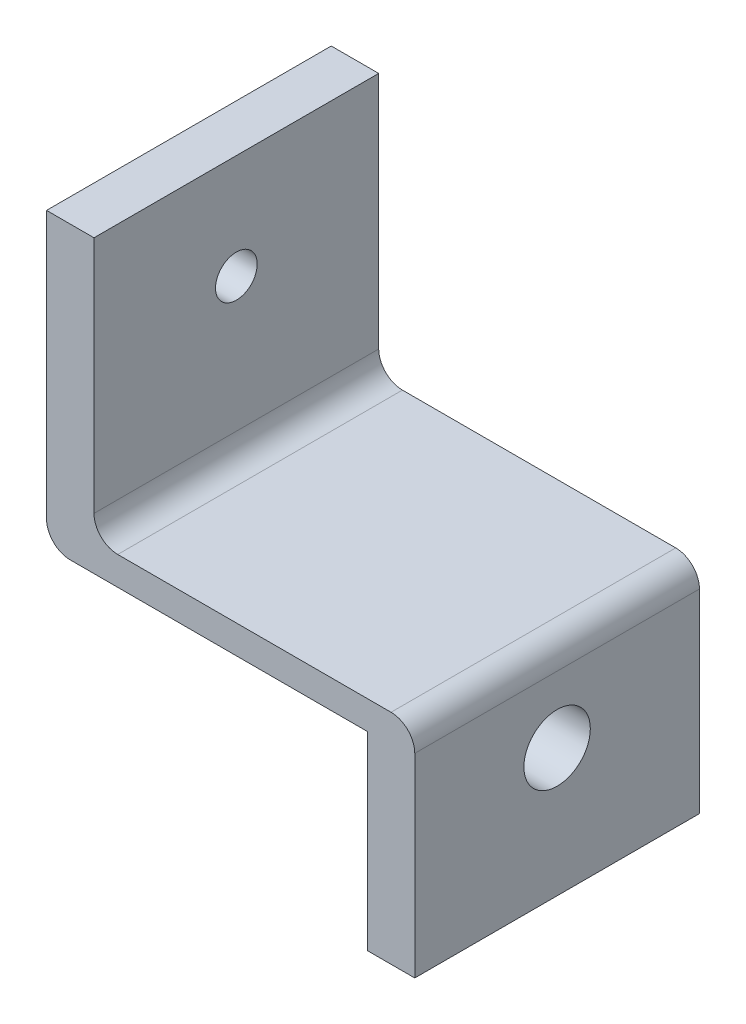
ISO-10303-21;
HEADER;
FILE_DESCRIPTION(('STEP AP214'),'2;1');
FILE_NAME('part.step','',(''),(''),'','','');
FILE_SCHEMA(('AUTOMOTIVE_DESIGN { 1 0 10303 214 1 1 1 1 }'));
ENDSEC;
DATA;
#1=APPLICATION_CONTEXT('core data for automotive mechanical design processes');
#2=APPLICATION_PROTOCOL_DEFINITION('international standard','automotive_design',2000,#1);
#3=PRODUCT_CONTEXT('',#1,'mechanical');
#4=PRODUCT('Part','Part','',(#3));
#5=PRODUCT_RELATED_PRODUCT_CATEGORY('part','',(#4));
#6=PRODUCT_DEFINITION_FORMATION('','',#4);
#7=PRODUCT_DEFINITION_CONTEXT('part definition',#1,'design');
#8=PRODUCT_DEFINITION('design','',#6,#7);
#9=PRODUCT_DEFINITION_SHAPE('','',#8);
#10=(LENGTH_UNIT() NAMED_UNIT(*) SI_UNIT(.MILLI.,.METRE.));
#11=(NAMED_UNIT(*) PLANE_ANGLE_UNIT() SI_UNIT($,.RADIAN.));
#12=(NAMED_UNIT(*) SI_UNIT($,.STERADIAN.) SOLID_ANGLE_UNIT());
#13=UNCERTAINTY_MEASURE_WITH_UNIT(LENGTH_MEASURE(1.E-05),#10,'distance_accuracy_value','');
#14=(GEOMETRIC_REPRESENTATION_CONTEXT(3) GLOBAL_UNCERTAINTY_ASSIGNED_CONTEXT((#13)) GLOBAL_UNIT_ASSIGNED_CONTEXT((#10,
#11,#12)) REPRESENTATION_CONTEXT('',''));
#15=CARTESIAN_POINT('',(0.,0.,0.));
#16=DIRECTION('',(0.,0.,1.));
#17=DIRECTION('',(1.,0.,0.));
#18=AXIS2_PLACEMENT_3D('',#15,#16,#17);
#19=CARTESIAN_POINT('',(5.00000000000023,2.4980018054066E-13,-30.));
#20=DIRECTION('',(1.,0.,0.));
#21=DIRECTION('',(0.,0.,-1.));
#22=AXIS2_PLACEMENT_3D('',#19,#20,#21);
#23=PLANE('',#22);
#24=CARTESIAN_POINT('',(5.00000000000023,19.6500000000003,-15.));
#25=DIRECTION('',(1.,0.,0.));
#26=DIRECTION('',(0.,0.,-1.));
#27=AXIS2_PLACEMENT_3D('',#24,#25,#26);
#28=CIRCLE('',#27,2.19709999999999);
#29=CARTESIAN_POINT('',(5.00000000000023,19.6500000000003,-17.1971));
#30=VERTEX_POINT('',#29);
#31=EDGE_CURVE('E195',#30,#30,#28,.T.);
#32=ORIENTED_EDGE('',*,*,#31,.F.);
#33=EDGE_LOOP('',(#32));
#34=FACE_BOUND('',#33,.T.);
#35=DIRECTION('',(0.,1.,0.));
#36=VECTOR('',#35,1.);
#37=CARTESIAN_POINT('',(5.,0.,0.));
#38=LINE('',#37,#36);
#39=CARTESIAN_POINT('',(5.,5.50000000000001,0.));
#40=VERTEX_POINT('',#39);
#41=CARTESIAN_POINT('',(5.,30.65,0.));
#42=VERTEX_POINT('',#41);
#43=EDGE_CURVE('E159',#40,#42,#38,.T.);
#44=ORIENTED_EDGE('',*,*,#43,.F.);
#45=DIRECTION('',(0.,0.,1.));
#46=VECTOR('',#45,1.);
#47=CARTESIAN_POINT('',(5.00000000000025,5.50000000000025,-30.));
#48=LINE('',#47,#46);
#49=CARTESIAN_POINT('',(5.00000000000025,5.50000000000025,-30.));
#50=VERTEX_POINT('',#49);
#51=EDGE_CURVE('E128',#40,#50,#48,.F.);
#52=ORIENTED_EDGE('',*,*,#51,.T.);
#53=DIRECTION('',(0.,1.,0.));
#54=VECTOR('',#53,1.);
#55=CARTESIAN_POINT('',(5.00000000000023,2.4980018054066E-13,-30.));
#56=LINE('',#55,#54);
#57=CARTESIAN_POINT('',(5.,30.6500000000002,-30.));
#58=VERTEX_POINT('',#57);
#59=EDGE_CURVE('E121',#50,#58,#56,.T.);
#60=ORIENTED_EDGE('',*,*,#59,.T.);
#61=DIRECTION('',(0.,0.,1.));
#62=VECTOR('',#61,1.);
#63=CARTESIAN_POINT('',(5.,30.6500000000002,-30.));
#64=LINE('',#63,#62);
#65=EDGE_CURVE('E125',#58,#42,#64,.T.);
#66=ORIENTED_EDGE('',*,*,#65,.T.);
#67=EDGE_LOOP('',(#44,#52,#60,#66));
#68=FACE_BOUND('',#67,.T.);
#69=ADVANCED_FACE('F38',(#34,#68),#23,.T.);
#70=CARTESIAN_POINT('',(38.8,0.,-30.));
#71=DIRECTION('',(1.,0.,0.));
#72=DIRECTION('',(0.,0.,-1.));
#73=AXIS2_PLACEMENT_3D('',#70,#71,#72);
#74=PLANE('',#73);
#75=DIRECTION('',(0.,1.,0.));
#76=VECTOR('',#75,1.);
#77=CARTESIAN_POINT('',(38.8,0.,-30.));
#78=LINE('',#77,#76);
#79=CARTESIAN_POINT('',(38.8,-20.,-30.));
#80=VERTEX_POINT('',#79);
#81=CARTESIAN_POINT('',(38.8000000000002,0.5,-30.));
#82=VERTEX_POINT('',#81);
#83=EDGE_CURVE('E147',#80,#82,#78,.T.);
#84=ORIENTED_EDGE('',*,*,#83,.T.);
#85=DIRECTION('',(0.,0.,-1.));
#86=VECTOR('',#85,1.);
#87=CARTESIAN_POINT('',(38.8,0.5,0.));
#88=LINE('',#87,#86);
#89=CARTESIAN_POINT('',(38.8,0.5,0.));
#90=VERTEX_POINT('',#89);
#91=EDGE_CURVE('E173',#82,#90,#88,.F.);
#92=ORIENTED_EDGE('',*,*,#91,.T.);
#93=DIRECTION('',(0.,1.,0.));
#94=VECTOR('',#93,1.);
#95=CARTESIAN_POINT('',(38.8,0.,0.));
#96=LINE('',#95,#94);
#97=CARTESIAN_POINT('',(38.8000000000003,-20.,0.));
#98=VERTEX_POINT('',#97);
#99=EDGE_CURVE('E132',#98,#90,#96,.T.);
#100=ORIENTED_EDGE('',*,*,#99,.F.);
#101=DIRECTION('',(0.,0.,1.));
#102=VECTOR('',#101,1.);
#103=CARTESIAN_POINT('',(38.8,-20.,-30.));
#104=LINE('',#103,#102);
#105=EDGE_CURVE('E165',#80,#98,#104,.T.);
#106=ORIENTED_EDGE('',*,*,#105,.F.);
#107=EDGE_LOOP('',(#84,#92,#100,#106));
#108=FACE_BOUND('',#107,.T.);
#109=CARTESIAN_POINT('',(38.8,-6.49999999999998,-15.));
#110=DIRECTION('',(1.,0.,0.));
#111=DIRECTION('',(0.,0.,-1.));
#112=AXIS2_PLACEMENT_3D('',#109,#110,#111);
#113=CIRCLE('',#112,3.5);
#114=CARTESIAN_POINT('',(38.8,-6.49999999999998,-18.5));
#115=VERTEX_POINT('',#114);
#116=EDGE_CURVE('E160',#115,#115,#113,.T.);
#117=ORIENTED_EDGE('',*,*,#116,.F.);
#118=EDGE_LOOP('',(#117));
#119=FACE_BOUND('',#118,.T.);
#120=ADVANCED_FACE('F243',(#108,#119),#74,.T.);
#121=CARTESIAN_POINT('',(38.8,-20.,-30.));
#122=DIRECTION('',(0.,1.,0.));
#123=DIRECTION('',(0.,0.,1.));
#124=AXIS2_PLACEMENT_3D('',#121,#122,#123);
#125=PLANE('',#124);
#126=DIRECTION('',(-1.,0.,0.));
#127=VECTOR('',#126,1.);
#128=CARTESIAN_POINT('',(38.8000000000003,-20.,0.));
#129=LINE('',#128,#127);
#130=CARTESIAN_POINT('',(33.8000000000002,-20.,0.));
#131=VERTEX_POINT('',#130);
#132=EDGE_CURVE('E220',#98,#131,#129,.T.);
#133=ORIENTED_EDGE('',*,*,#132,.T.);
#134=DIRECTION('',(0.,0.,1.));
#135=VECTOR('',#134,1.);
#136=CARTESIAN_POINT('',(33.8,-20.,-30.));
#137=LINE('',#136,#135);
#138=CARTESIAN_POINT('',(33.8,-20.,-30.));
#139=VERTEX_POINT('',#138);
#140=EDGE_CURVE('E224',#139,#131,#137,.T.);
#141=ORIENTED_EDGE('',*,*,#140,.F.);
#142=DIRECTION('',(-1.,0.,0.));
#143=VECTOR('',#142,1.);
#144=CARTESIAN_POINT('',(38.8,-20.,-30.));
#145=LINE('',#144,#143);
#146=EDGE_CURVE('E152',#80,#139,#145,.T.);
#147=ORIENTED_EDGE('',*,*,#146,.F.);
#148=ORIENTED_EDGE('',*,*,#105,.T.);
#149=EDGE_LOOP('',(#133,#141,#147,#148));
#150=FACE_BOUND('',#149,.T.);
#151=ADVANCED_FACE('F240',(#150),#125,.F.);
#152=CARTESIAN_POINT('',(33.8,0.,-30.));
#153=DIRECTION('',(1.,0.,0.));
#154=DIRECTION('',(0.,0.,-1.));
#155=AXIS2_PLACEMENT_3D('',#152,#153,#154);
#156=PLANE('',#155);
#157=CARTESIAN_POINT('',(33.8,-6.49999999999995,-15.));
#158=DIRECTION('',(1.,0.,0.));
#159=DIRECTION('',(0.,0.,-1.));
#160=AXIS2_PLACEMENT_3D('',#157,#158,#159);
#161=CIRCLE('',#160,3.49999999999999);
#162=CARTESIAN_POINT('',(33.8,-6.49999999999995,-18.5));
#163=VERTEX_POINT('',#162);
#164=EDGE_CURVE('E156',#163,#163,#161,.T.);
#165=ORIENTED_EDGE('',*,*,#164,.T.);
#166=EDGE_LOOP('',(#165));
#167=FACE_BOUND('',#166,.T.);
#168=DIRECTION('',(0.,1.,0.));
#169=VECTOR('',#168,1.);
#170=CARTESIAN_POINT('',(33.8,0.,0.));
#171=LINE('',#170,#169);
#172=CARTESIAN_POINT('',(33.8,0.,0.));
#173=VERTEX_POINT('',#172);
#174=EDGE_CURVE('E218',#131,#173,#171,.T.);
#175=ORIENTED_EDGE('',*,*,#174,.T.);
#176=DIRECTION('',(0.,0.,1.));
#177=VECTOR('',#176,1.);
#178=CARTESIAN_POINT('',(33.8,0.,-30.));
#179=LINE('',#178,#177);
#180=CARTESIAN_POINT('',(33.8,0.,-30.));
#181=VERTEX_POINT('',#180);
#182=EDGE_CURVE('E149',#181,#173,#179,.T.);
#183=ORIENTED_EDGE('',*,*,#182,.F.);
#184=DIRECTION('',(0.,1.,0.));
#185=VECTOR('',#184,1.);
#186=CARTESIAN_POINT('',(33.8,0.,-30.));
#187=LINE('',#186,#185);
#188=EDGE_CURVE('E210',#139,#181,#187,.T.);
#189=ORIENTED_EDGE('',*,*,#188,.F.);
#190=ORIENTED_EDGE('',*,*,#140,.T.);
#191=EDGE_LOOP('',(#175,#183,#189,#190));
#192=FACE_BOUND('',#191,.T.);
#193=ADVANCED_FACE('F236',(#167,#192),#156,.F.);
#194=CARTESIAN_POINT('',(2.4980018054066E-13,2.4980018054066E-13,-30.));
#195=DIRECTION('',(0.,1.,0.));
#196=DIRECTION('',(0.,0.,1.));
#197=AXIS2_PLACEMENT_3D('',#194,#195,#196);
#198=PLANE('',#197);
#199=DIRECTION('',(-1.,0.,0.));
#200=VECTOR('',#199,1.);
#201=CARTESIAN_POINT('',(0.,0.,0.));
#202=LINE('',#201,#200);
#203=CARTESIAN_POINT('',(2.5,0.,0.));
#204=VERTEX_POINT('',#203);
#205=EDGE_CURVE('E216',#173,#204,#202,.T.);
#206=ORIENTED_EDGE('',*,*,#205,.T.);
#207=DIRECTION('',(0.,0.,1.));
#208=VECTOR('',#207,1.);
#209=CARTESIAN_POINT('',(2.50000000000025,2.4980018054066E-13,-30.));
#210=LINE('',#209,#208);
#211=CARTESIAN_POINT('',(2.50000000000025,2.4980018054066E-13,-30.));
#212=VERTEX_POINT('',#211);
#213=EDGE_CURVE('E180',#204,#212,#210,.F.);
#214=ORIENTED_EDGE('',*,*,#213,.T.);
#215=DIRECTION('',(-1.,0.,0.));
#216=VECTOR('',#215,1.);
#217=CARTESIAN_POINT('',(2.4980018054066E-13,2.4980018054066E-13,-30.));
#218=LINE('',#217,#216);
#219=EDGE_CURVE('E207',#181,#212,#218,.T.);
#220=ORIENTED_EDGE('',*,*,#219,.F.);
#221=ORIENTED_EDGE('',*,*,#182,.T.);
#222=EDGE_LOOP('',(#206,#214,#220,#221));
#223=FACE_BOUND('',#222,.T.);
#224=ADVANCED_FACE('F230',(#223),#198,.F.);
#225=CARTESIAN_POINT('',(2.4980018054066E-13,2.4980018054066E-13,-30.));
#226=DIRECTION('',(1.,0.,0.));
#227=DIRECTION('',(0.,0.,-1.));
#228=AXIS2_PLACEMENT_3D('',#225,#226,#227);
#229=PLANE('',#228);
#230=CARTESIAN_POINT('',(2.4980018054066E-13,19.6500000000003,-15.));
#231=DIRECTION('',(1.,0.,0.));
#232=DIRECTION('',(0.,0.,-1.));
#233=AXIS2_PLACEMENT_3D('',#230,#231,#232);
#234=CIRCLE('',#233,2.1971);
#235=CARTESIAN_POINT('',(2.4980018054066E-13,19.6500000000003,-17.1971));
#236=VERTEX_POINT('',#235);
#237=EDGE_CURVE('E198',#236,#236,#234,.T.);
#238=ORIENTED_EDGE('',*,*,#237,.T.);
#239=EDGE_LOOP('',(#238));
#240=FACE_BOUND('',#239,.T.);
#241=DIRECTION('',(0.,1.,0.));
#242=VECTOR('',#241,1.);
#243=CARTESIAN_POINT('',(2.4980018054066E-13,2.4980018054066E-13,-30.));
#244=LINE('',#243,#242);
#245=CARTESIAN_POINT('',(2.4980018054066E-13,2.50000000000025,-30.));
#246=VERTEX_POINT('',#245);
#247=CARTESIAN_POINT('',(0.,30.6500000000002,-30.));
#248=VERTEX_POINT('',#247);
#249=EDGE_CURVE('E138',#246,#248,#244,.T.);
#250=ORIENTED_EDGE('',*,*,#249,.F.);
#251=DIRECTION('',(0.,0.,1.));
#252=VECTOR('',#251,1.);
#253=CARTESIAN_POINT('',(2.4980018054066E-13,2.50000000000025,-30.));
#254=LINE('',#253,#252);
#255=CARTESIAN_POINT('',(0.,2.5,0.));
#256=VERTEX_POINT('',#255);
#257=EDGE_CURVE('E178',#246,#256,#254,.T.);
#258=ORIENTED_EDGE('',*,*,#257,.T.);
#259=DIRECTION('',(0.,1.,0.));
#260=VECTOR('',#259,1.);
#261=CARTESIAN_POINT('',(0.,0.,0.));
#262=LINE('',#261,#260);
#263=CARTESIAN_POINT('',(0.,30.65,0.));
#264=VERTEX_POINT('',#263);
#265=EDGE_CURVE('E214',#256,#264,#262,.T.);
#266=ORIENTED_EDGE('',*,*,#265,.T.);
#267=DIRECTION('',(0.,0.,1.));
#268=VECTOR('',#267,1.);
#269=CARTESIAN_POINT('',(0.,30.6500000000002,-30.));
#270=LINE('',#269,#268);
#271=EDGE_CURVE('E146',#248,#264,#270,.T.);
#272=ORIENTED_EDGE('',*,*,#271,.F.);
#273=EDGE_LOOP('',(#250,#258,#266,#272));
#274=FACE_BOUND('',#273,.T.);
#275=ADVANCED_FACE('F251',(#240,#274),#229,.F.);
#276=CARTESIAN_POINT('',(0.,30.6500000000002,-30.));
#277=DIRECTION('',(0.,-1.,0.));
#278=DIRECTION('',(0.,0.,-1.));
#279=AXIS2_PLACEMENT_3D('',#276,#277,#278);
#280=PLANE('',#279);
#281=DIRECTION('',(1.,0.,0.));
#282=VECTOR('',#281,1.);
#283=CARTESIAN_POINT('',(0.,30.65,0.));
#284=LINE('',#283,#282);
#285=EDGE_CURVE('E145',#264,#42,#284,.T.);
#286=ORIENTED_EDGE('',*,*,#285,.T.);
#287=ORIENTED_EDGE('',*,*,#65,.F.);
#288=DIRECTION('',(1.,0.,0.));
#289=VECTOR('',#288,1.);
#290=CARTESIAN_POINT('',(0.,30.6500000000002,-30.));
#291=LINE('',#290,#289);
#292=EDGE_CURVE('E131',#248,#58,#291,.T.);
#293=ORIENTED_EDGE('',*,*,#292,.F.);
#294=ORIENTED_EDGE('',*,*,#271,.T.);
#295=EDGE_LOOP('',(#286,#287,#293,#294));
#296=FACE_BOUND('',#295,.T.);
#297=ADVANCED_FACE('F143',(#296),#280,.F.);
#298=CARTESIAN_POINT('',(5.,30.6500000000002,-30.));
#299=DIRECTION('',(0.,0.,-1.));
#300=DIRECTION('',(-1.,0.,0.));
#301=AXIS2_PLACEMENT_3D('',#298,#299,#300);
#302=PLANE('',#301);
#303=DIRECTION('',(1.,0.,0.));
#304=VECTOR('',#303,1.);
#305=CARTESIAN_POINT('',(5.00000000000025,3.00000000000025,-30.));
#306=LINE('',#305,#304);
#307=CARTESIAN_POINT('',(7.50000000000023,3.00000000000025,-30.));
#308=VERTEX_POINT('',#307);
#309=CARTESIAN_POINT('',(36.3000000000002,3.,-30.));
#310=VERTEX_POINT('',#309);
#311=EDGE_CURVE('E191',#308,#310,#306,.T.);
#312=ORIENTED_EDGE('',*,*,#311,.T.);
#313=CARTESIAN_POINT('',(36.3000000000002,0.5,-30.));
#314=DIRECTION('',(0.,0.,-1.));
#315=DIRECTION('',(-1.,0.,0.));
#316=AXIS2_PLACEMENT_3D('',#313,#314,#315);
#317=CIRCLE('',#316,2.5);
#318=EDGE_CURVE('E171',#310,#82,#317,.T.);
#319=ORIENTED_EDGE('',*,*,#318,.T.);
#320=ORIENTED_EDGE('',*,*,#83,.F.);
#321=ORIENTED_EDGE('',*,*,#146,.T.);
#322=ORIENTED_EDGE('',*,*,#188,.T.);
#323=ORIENTED_EDGE('',*,*,#219,.T.);
#324=CARTESIAN_POINT('',(2.50000000000025,2.50000000000025,-30.));
#325=DIRECTION('',(0.,0.,-1.));
#326=DIRECTION('',(-1.,0.,0.));
#327=AXIS2_PLACEMENT_3D('',#324,#325,#326);
#328=CIRCLE('',#327,2.5);
#329=EDGE_CURVE('E169',#212,#246,#328,.T.);
#330=ORIENTED_EDGE('',*,*,#329,.T.);
#331=ORIENTED_EDGE('',*,*,#249,.T.);
#332=ORIENTED_EDGE('',*,*,#292,.T.);
#333=ORIENTED_EDGE('',*,*,#59,.F.);
#334=CARTESIAN_POINT('',(7.50000000000023,5.50000000000023,-30.));
#335=DIRECTION('',(0.,0.,-1.));
#336=DIRECTION('',(-1.,0.,0.));
#337=AXIS2_PLACEMENT_3D('',#334,#335,#336);
#338=CIRCLE('',#337,2.5);
#339=EDGE_CURVE('E11',#50,#308,#338,.F.);
#340=ORIENTED_EDGE('',*,*,#339,.T.);
#341=EDGE_LOOP('',(#312,#319,#320,#321,#322,#323,#330,#331,#332,#333,#340));
#342=FACE_BOUND('',#341,.T.);
#343=ADVANCED_FACE('F136',(#342),#302,.T.);
#344=CARTESIAN_POINT('',(5.,30.65,0.));
#345=DIRECTION('',(0.,0.,-1.));
#346=DIRECTION('',(-1.,0.,0.));
#347=AXIS2_PLACEMENT_3D('',#344,#345,#346);
#348=PLANE('',#347);
#349=ORIENTED_EDGE('',*,*,#99,.T.);
#350=CARTESIAN_POINT('',(36.3,0.5,0.));
#351=DIRECTION('',(0.,0.,-1.));
#352=DIRECTION('',(-1.,0.,0.));
#353=AXIS2_PLACEMENT_3D('',#350,#351,#352);
#354=CIRCLE('',#353,2.5);
#355=CARTESIAN_POINT('',(36.3,3.,0.));
#356=VERTEX_POINT('',#355);
#357=EDGE_CURVE('E176',#90,#356,#354,.F.);
#358=ORIENTED_EDGE('',*,*,#357,.T.);
#359=DIRECTION('',(1.,0.,0.));
#360=VECTOR('',#359,1.);
#361=CARTESIAN_POINT('',(5.,3.,0.));
#362=LINE('',#361,#360);
#363=CARTESIAN_POINT('',(7.50000000000001,3.,0.));
#364=VERTEX_POINT('',#363);
#365=EDGE_CURVE('E185',#364,#356,#362,.T.);
#366=ORIENTED_EDGE('',*,*,#365,.F.);
#367=CARTESIAN_POINT('',(7.50000000000001,5.50000000000001,0.));
#368=DIRECTION('',(0.,0.,-1.));
#369=DIRECTION('',(-1.,0.,0.));
#370=AXIS2_PLACEMENT_3D('',#367,#368,#369);
#371=CIRCLE('',#370,2.5);
#372=EDGE_CURVE('E46',#364,#40,#371,.T.);
#373=ORIENTED_EDGE('',*,*,#372,.T.);
#374=ORIENTED_EDGE('',*,*,#43,.T.);
#375=ORIENTED_EDGE('',*,*,#285,.F.);
#376=ORIENTED_EDGE('',*,*,#265,.F.);
#377=CARTESIAN_POINT('',(2.5,2.5,0.));
#378=DIRECTION('',(0.,0.,-1.));
#379=DIRECTION('',(-1.,0.,0.));
#380=AXIS2_PLACEMENT_3D('',#377,#378,#379);
#381=CIRCLE('',#380,2.5);
#382=EDGE_CURVE('E53',#256,#204,#381,.F.);
#383=ORIENTED_EDGE('',*,*,#382,.T.);
#384=ORIENTED_EDGE('',*,*,#205,.F.);
#385=ORIENTED_EDGE('',*,*,#174,.F.);
#386=ORIENTED_EDGE('',*,*,#132,.F.);
#387=EDGE_LOOP('',(#349,#358,#366,#373,#374,#375,#376,#383,#384,#385,#386));
#388=FACE_BOUND('',#387,.T.);
#389=ADVANCED_FACE('F183',(#388),#348,.F.);
#390=CARTESIAN_POINT('',(38.8,-6.49999999999998,-15.));
#391=DIRECTION('',(1.,0.,0.));
#392=DIRECTION('',(0.,0.,-1.));
#393=AXIS2_PLACEMENT_3D('',#390,#391,#392);
#394=CYLINDRICAL_SURFACE('',#393,3.49999999999999);
#395=ORIENTED_EDGE('',*,*,#116,.T.);
#396=EDGE_LOOP('',(#395));
#397=FACE_BOUND('',#396,.T.);
#398=ORIENTED_EDGE('',*,*,#164,.F.);
#399=EDGE_LOOP('',(#398));
#400=FACE_BOUND('',#399,.T.);
#401=ADVANCED_FACE('F307',(#397,#400),#394,.F.);
#402=CARTESIAN_POINT('',(5.00000000000023,19.6500000000003,-15.));
#403=DIRECTION('',(1.,0.,0.));
#404=DIRECTION('',(0.,0.,-1.));
#405=AXIS2_PLACEMENT_3D('',#402,#403,#404);
#406=CYLINDRICAL_SURFACE('',#405,2.19709999999999);
#407=ORIENTED_EDGE('',*,*,#237,.F.);
#408=EDGE_LOOP('',(#407));
#409=FACE_BOUND('',#408,.T.);
#410=ORIENTED_EDGE('',*,*,#31,.T.);
#411=EDGE_LOOP('',(#410));
#412=FACE_BOUND('',#411,.T.);
#413=ADVANCED_FACE('F296',(#409,#412),#406,.F.);
#414=CARTESIAN_POINT('',(5.00000000000025,3.00000000000025,-30.));
#415=DIRECTION('',(0.,-1.,0.));
#416=DIRECTION('',(0.,0.,-1.));
#417=AXIS2_PLACEMENT_3D('',#414,#415,#416);
#418=PLANE('',#417);
#419=ORIENTED_EDGE('',*,*,#311,.F.);
#420=DIRECTION('',(0.,0.,1.));
#421=VECTOR('',#420,1.);
#422=CARTESIAN_POINT('',(7.50000000000023,3.00000000000025,-30.));
#423=LINE('',#422,#421);
#424=EDGE_CURVE('E164',#308,#364,#423,.T.);
#425=ORIENTED_EDGE('',*,*,#424,.T.);
#426=ORIENTED_EDGE('',*,*,#365,.T.);
#427=DIRECTION('',(0.,0.,-1.));
#428=VECTOR('',#427,1.);
#429=CARTESIAN_POINT('',(36.3000000000002,3.,-30.));
#430=LINE('',#429,#428);
#431=EDGE_CURVE('E161',#356,#310,#430,.T.);
#432=ORIENTED_EDGE('',*,*,#431,.T.);
#433=EDGE_LOOP('',(#419,#425,#426,#432));
#434=FACE_BOUND('',#433,.T.);
#435=ADVANCED_FACE('F193',(#434),#418,.F.);
#436=CARTESIAN_POINT('',(7.50000000000023,5.50000000000023,-30.));
#437=DIRECTION('',(0.,0.,1.));
#438=DIRECTION('',(1.,0.,0.));
#439=AXIS2_PLACEMENT_3D('',#436,#437,#438);
#440=CYLINDRICAL_SURFACE('',#439,2.5);
#441=ORIENTED_EDGE('',*,*,#339,.F.);
#442=ORIENTED_EDGE('',*,*,#51,.F.);
#443=ORIENTED_EDGE('',*,*,#372,.F.);
#444=ORIENTED_EDGE('',*,*,#424,.F.);
#445=EDGE_LOOP('',(#441,#442,#443,#444));
#446=FACE_BOUND('',#445,.T.);
#447=ADVANCED_FACE('F189',(#446),#440,.F.);
#448=CARTESIAN_POINT('',(36.3000000000002,0.5,-30.));
#449=DIRECTION('',(0.,0.,1.));
#450=DIRECTION('',(1.,0.,0.));
#451=AXIS2_PLACEMENT_3D('',#448,#449,#450);
#452=CYLINDRICAL_SURFACE('',#451,2.5);
#453=ORIENTED_EDGE('',*,*,#357,.F.);
#454=ORIENTED_EDGE('',*,*,#91,.F.);
#455=ORIENTED_EDGE('',*,*,#318,.F.);
#456=ORIENTED_EDGE('',*,*,#431,.F.);
#457=EDGE_LOOP('',(#453,#454,#455,#456));
#458=FACE_BOUND('',#457,.T.);
#459=ADVANCED_FACE('F248',(#458),#452,.T.);
#460=CARTESIAN_POINT('',(2.50000000000025,2.50000000000025,-30.));
#461=DIRECTION('',(0.,0.,1.));
#462=DIRECTION('',(1.,0.,0.));
#463=AXIS2_PLACEMENT_3D('',#460,#461,#462);
#464=CYLINDRICAL_SURFACE('',#463,2.5);
#465=ORIENTED_EDGE('',*,*,#329,.F.);
#466=ORIENTED_EDGE('',*,*,#213,.F.);
#467=ORIENTED_EDGE('',*,*,#382,.F.);
#468=ORIENTED_EDGE('',*,*,#257,.F.);
#469=EDGE_LOOP('',(#465,#466,#467,#468));
#470=FACE_BOUND('',#469,.T.);
#471=ADVANCED_FACE('F40',(#470),#464,.T.);
#472=CLOSED_SHELL('',(#69,#120,#151,#193,#224,#275,#297,#343,#389,#401,#413,#435,#447,#459,#471));
#473=MANIFOLD_SOLID_BREP('B2',#472);
#474=ADVANCED_BREP_SHAPE_REPRESENTATION('',(#18,#473),#14);
#475=SHAPE_DEFINITION_REPRESENTATION(#9,#474);
ENDSEC;
END-ISO-10303-21;
